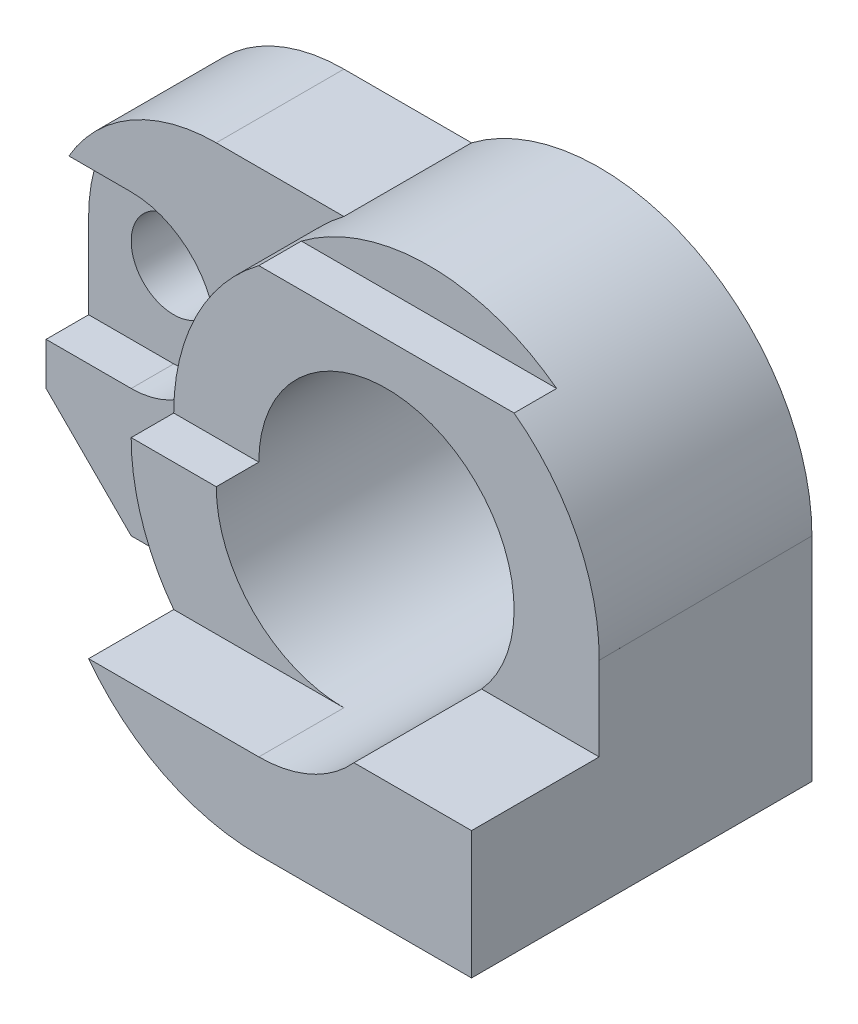
ISO-10303-21;
HEADER;
FILE_DESCRIPTION(('STEP AP214'),'2;1');
FILE_NAME('part.step','',(''),(''),'','','');
FILE_SCHEMA(('AUTOMOTIVE_DESIGN { 1 0 10303 214 1 1 1 1 }'));
ENDSEC;
DATA;
#1=APPLICATION_CONTEXT('core data for automotive mechanical design processes');
#2=APPLICATION_PROTOCOL_DEFINITION('international standard','automotive_design',2000,#1);
#3=PRODUCT_CONTEXT('',#1,'mechanical');
#4=PRODUCT('Part','Part','',(#3));
#5=PRODUCT_RELATED_PRODUCT_CATEGORY('part','',(#4));
#6=PRODUCT_DEFINITION_FORMATION('','',#4);
#7=PRODUCT_DEFINITION_CONTEXT('part definition',#1,'design');
#8=PRODUCT_DEFINITION('design','',#6,#7);
#9=PRODUCT_DEFINITION_SHAPE('','',#8);
#10=(LENGTH_UNIT() NAMED_UNIT(*) SI_UNIT(.MILLI.,.METRE.));
#11=(NAMED_UNIT(*) PLANE_ANGLE_UNIT() SI_UNIT($,.RADIAN.));
#12=(NAMED_UNIT(*) SI_UNIT($,.STERADIAN.) SOLID_ANGLE_UNIT());
#13=UNCERTAINTY_MEASURE_WITH_UNIT(LENGTH_MEASURE(1.E-05),#10,'distance_accuracy_value','');
#14=(GEOMETRIC_REPRESENTATION_CONTEXT(3) GLOBAL_UNCERTAINTY_ASSIGNED_CONTEXT((#13)) GLOBAL_UNIT_ASSIGNED_CONTEXT((#10,
#11,#12)) REPRESENTATION_CONTEXT('',''));
#15=CARTESIAN_POINT('',(0.,0.,0.));
#16=DIRECTION('',(0.,0.,1.));
#17=DIRECTION('',(1.,0.,0.));
#18=AXIS2_PLACEMENT_3D('',#15,#16,#17);
#19=CARTESIAN_POINT('',(0.,0.,40.));
#20=DIRECTION('',(0.,0.,-1.));
#21=DIRECTION('',(-1.,0.,0.));
#22=AXIS2_PLACEMENT_3D('',#19,#20,#21);
#23=CYLINDRICAL_SURFACE('',#22,50.);
#24=CARTESIAN_POINT('',(0.,0.,30.));
#25=DIRECTION('',(0.,0.,-1.));
#26=DIRECTION('',(-1.,0.,0.));
#27=AXIS2_PLACEMENT_3D('',#24,#25,#26);
#28=CIRCLE('',#27,50.);
#29=CARTESIAN_POINT('',(0.,-50.,30.));
#30=VERTEX_POINT('',#29);
#31=CARTESIAN_POINT('',(-30.,40.,30.));
#32=VERTEX_POINT('',#31);
#33=EDGE_CURVE('E195',#30,#32,#28,.T.);
#34=ORIENTED_EDGE('',*,*,#33,.F.);
#35=DIRECTION('',(0.,0.,-1.));
#36=VECTOR('',#35,1.);
#37=CARTESIAN_POINT('',(0.,-50.,50.));
#38=LINE('',#37,#36);
#39=CARTESIAN_POINT('',(0.,-50.,80.));
#40=VERTEX_POINT('',#39);
#41=EDGE_CURVE('E180',#40,#30,#38,.T.);
#42=ORIENTED_EDGE('',*,*,#41,.F.);
#43=CARTESIAN_POINT('',(0.,0.,80.));
#44=DIRECTION('',(0.,0.,1.));
#45=DIRECTION('',(1.,0.,0.));
#46=AXIS2_PLACEMENT_3D('',#43,#44,#45);
#47=CIRCLE('',#46,50.);
#48=CARTESIAN_POINT('',(-40.,-30.,80.));
#49=VERTEX_POINT('',#48);
#50=EDGE_CURVE('E420',#49,#40,#47,.T.);
#51=ORIENTED_EDGE('',*,*,#50,.F.);
#52=DIRECTION('',(0.,0.,-1.));
#53=VECTOR('',#52,1.);
#54=CARTESIAN_POINT('',(-40.,-30.,70.));
#55=LINE('',#54,#53);
#56=CARTESIAN_POINT('',(-40.,-30.,60.));
#57=VERTEX_POINT('',#56);
#58=EDGE_CURVE('E274',#49,#57,#55,.T.);
#59=ORIENTED_EDGE('',*,*,#58,.T.);
#60=CARTESIAN_POINT('',(0.,0.,60.));
#61=DIRECTION('',(0.,0.,1.));
#62=DIRECTION('',(1.,0.,0.));
#63=AXIS2_PLACEMENT_3D('',#60,#61,#62);
#64=CIRCLE('',#63,50.);
#65=CARTESIAN_POINT('',(-50.,0.,60.));
#66=VERTEX_POINT('',#65);
#67=EDGE_CURVE('E264',#66,#57,#64,.T.);
#68=ORIENTED_EDGE('',*,*,#67,.F.);
#69=DIRECTION('',(0.,0.,-1.));
#70=VECTOR('',#69,1.);
#71=CARTESIAN_POINT('',(-50.,0.,60.));
#72=LINE('',#71,#70);
#73=CARTESIAN_POINT('',(-50.,0.,50.));
#74=VERTEX_POINT('',#73);
#75=EDGE_CURVE('E267',#66,#74,#72,.T.);
#76=ORIENTED_EDGE('',*,*,#75,.T.);
#77=CARTESIAN_POINT('',(0.,0.,50.));
#78=DIRECTION('',(0.,0.,1.));
#79=DIRECTION('',(1.,0.,0.));
#80=AXIS2_PLACEMENT_3D('',#77,#78,#79);
#81=CIRCLE('',#80,50.);
#82=CARTESIAN_POINT('',(-30.,40.,50.));
#83=VERTEX_POINT('',#82);
#84=EDGE_CURVE('E229',#83,#74,#81,.T.);
#85=ORIENTED_EDGE('',*,*,#84,.F.);
#86=DIRECTION('',(0.,0.,1.));
#87=VECTOR('',#86,1.);
#88=CARTESIAN_POINT('',(-30.,40.,40.));
#89=LINE('',#88,#87);
#90=CARTESIAN_POINT('',(-30.,40.,40.));
#91=VERTEX_POINT('',#90);
#92=EDGE_CURVE('E391',#91,#83,#89,.T.);
#93=ORIENTED_EDGE('',*,*,#92,.F.);
#94=CARTESIAN_POINT('',(0.,0.,40.));
#95=DIRECTION('',(0.,0.,1.));
#96=DIRECTION('',(-1.,0.,0.));
#97=AXIS2_PLACEMENT_3D('',#94,#95,#96);
#98=CIRCLE('',#97,50.);
#99=CARTESIAN_POINT('',(30.,40.,40.));
#100=VERTEX_POINT('',#99);
#101=EDGE_CURVE('E424',#100,#91,#98,.T.);
#102=ORIENTED_EDGE('',*,*,#101,.F.);
#103=DIRECTION('',(0.,0.,1.));
#104=VECTOR('',#103,1.);
#105=CARTESIAN_POINT('',(30.,40.,40.));
#106=LINE('',#105,#104);
#107=CARTESIAN_POINT('',(30.,40.,50.));
#108=VERTEX_POINT('',#107);
#109=EDGE_CURVE('E386',#100,#108,#106,.T.);
#110=ORIENTED_EDGE('',*,*,#109,.T.);
#111=CARTESIAN_POINT('',(49.998917391078,-0.329028448868275,50.));
#112=VERTEX_POINT('',#111);
#113=EDGE_CURVE('E230',#112,#108,#81,.T.);
#114=ORIENTED_EDGE('',*,*,#113,.F.);
#115=CARTESIAN_POINT('',(0.,0.,0.));
#116=DIRECTION('',(1.10859201595795E-07,0.999978349488609,0.00658031564788068));
#117=DIRECTION('',(7.29504333114237E-10,0.00658031564788063,-0.999978349488615));
#118=AXIS2_PLACEMENT_3D('',#115,#116,#117);
#119=ELLIPSE('',#118,7598.41969223825,50.);
#120=CARTESIAN_POINT('',(49.9999999999998,-5.54308007596687E-06,0.));
#121=VERTEX_POINT('',#120);
#122=EDGE_CURVE('E382',#112,#121,#119,.T.);
#123=ORIENTED_EDGE('',*,*,#122,.T.);
#124=CARTESIAN_POINT('',(0.,0.,0.));
#125=DIRECTION('',(0.,0.,1.));
#126=DIRECTION('',(1.,0.,0.));
#127=AXIS2_PLACEMENT_3D('',#124,#125,#126);
#128=CIRCLE('',#127,50.);
#129=CARTESIAN_POINT('',(-30.,40.,0.));
#130=VERTEX_POINT('',#129);
#131=EDGE_CURVE('E11',#121,#130,#128,.T.);
#132=ORIENTED_EDGE('',*,*,#131,.T.);
#133=DIRECTION('',(0.,0.,-1.));
#134=VECTOR('',#133,1.);
#135=CARTESIAN_POINT('',(-30.,40.,30.));
#136=LINE('',#135,#134);
#137=EDGE_CURVE('E197',#32,#130,#136,.T.);
#138=ORIENTED_EDGE('',*,*,#137,.F.);
#139=EDGE_LOOP('',(#34,#42,#51,#59,#68,#76,#85,#93,#102,#110,#114,#123,#132,#138));
#140=FACE_BOUND('',#139,.T.);
#141=ADVANCED_FACE('F35',(#140),#23,.T.);
#142=CARTESIAN_POINT('',(0.,0.,0.));
#143=DIRECTION('',(0.,0.,1.));
#144=DIRECTION('',(1.,0.,0.));
#145=AXIS2_PLACEMENT_3D('',#142,#143,#144);
#146=PLANE('',#145);
#147=DIRECTION('',(-1.,0.,0.));
#148=VECTOR('',#147,1.);
#149=CARTESIAN_POINT('',(0.,-50.,0.));
#150=LINE('',#149,#148);
#151=CARTESIAN_POINT('',(49.9999944569202,-50.,0.));
#152=VERTEX_POINT('',#151);
#153=CARTESIAN_POINT('',(-80.,-50.,0.));
#154=VERTEX_POINT('',#153);
#155=EDGE_CURVE('E293',#152,#154,#150,.T.);
#156=ORIENTED_EDGE('',*,*,#155,.T.);
#157=DIRECTION('',(0.707106781186547,-0.707106781186548,0.));
#158=VECTOR('',#157,1.);
#159=CARTESIAN_POINT('',(-65.0000000000001,-65.,0.));
#160=LINE('',#159,#158);
#161=CARTESIAN_POINT('',(-100.,-30.,0.));
#162=VERTEX_POINT('',#161);
#163=EDGE_CURVE('E218',#162,#154,#160,.T.);
#164=ORIENTED_EDGE('',*,*,#163,.F.);
#165=DIRECTION('',(0.,-1.,0.));
#166=VECTOR('',#165,1.);
#167=CARTESIAN_POINT('',(-100.,0.,0.));
#168=LINE('',#167,#166);
#169=CARTESIAN_POINT('',(-100.,0.,0.));
#170=VERTEX_POINT('',#169);
#171=EDGE_CURVE('E212',#170,#162,#168,.T.);
#172=ORIENTED_EDGE('',*,*,#171,.F.);
#173=CARTESIAN_POINT('',(-60.,0.,0.));
#174=DIRECTION('',(0.,0.,1.));
#175=DIRECTION('',(1.,0.,0.));
#176=AXIS2_PLACEMENT_3D('',#173,#174,#175);
#177=CIRCLE('',#176,40.);
#178=CARTESIAN_POINT('',(-60.,40.,0.));
#179=VERTEX_POINT('',#178);
#180=EDGE_CURVE('E333',#170,#179,#177,.F.);
#181=ORIENTED_EDGE('',*,*,#180,.T.);
#182=DIRECTION('',(-1.,0.,0.));
#183=VECTOR('',#182,1.);
#184=CARTESIAN_POINT('',(0.,40.,0.));
#185=LINE('',#184,#183);
#186=EDGE_CURVE('E214',#130,#179,#185,.T.);
#187=ORIENTED_EDGE('',*,*,#186,.F.);
#188=ORIENTED_EDGE('',*,*,#131,.F.);
#189=DIRECTION('',(-1.10861601806167E-07,-0.999999999999994,0.));
#190=VECTOR('',#189,1.);
#191=CARTESIAN_POINT('',(49.9999999999997,-5.54308009030835E-06,0.));
#192=LINE('',#191,#190);
#193=EDGE_CURVE('E56',#121,#152,#192,.T.);
#194=ORIENTED_EDGE('',*,*,#193,.T.);
#195=EDGE_LOOP('',(#156,#164,#172,#181,#187,#188,#194));
#196=FACE_BOUND('',#195,.T.);
#197=CARTESIAN_POINT('',(0.,0.,0.));
#198=DIRECTION('',(0.,0.,1.));
#199=DIRECTION('',(1.,0.,0.));
#200=AXIS2_PLACEMENT_3D('',#197,#198,#199);
#201=CIRCLE('',#200,30.);
#202=CARTESIAN_POINT('',(30.,0.,0.));
#203=VERTEX_POINT('',#202);
#204=EDGE_CURVE('E42',#203,#203,#201,.T.);
#205=ORIENTED_EDGE('',*,*,#204,.T.);
#206=EDGE_LOOP('',(#205));
#207=FACE_BOUND('',#206,.T.);
#208=CARTESIAN_POINT('',(-80.,0.,0.));
#209=DIRECTION('',(0.,0.,1.));
#210=DIRECTION('',(1.,0.,0.));
#211=AXIS2_PLACEMENT_3D('',#208,#209,#210);
#212=CIRCLE('',#211,9.99999999999999);
#213=CARTESIAN_POINT('',(-70.,0.,0.));
#214=VERTEX_POINT('',#213);
#215=EDGE_CURVE('E215',#214,#214,#212,.T.);
#216=ORIENTED_EDGE('',*,*,#215,.T.);
#217=EDGE_LOOP('',(#216));
#218=FACE_BOUND('',#217,.T.);
#219=ADVANCED_FACE('F237',(#196,#207,#218),#146,.F.);
#220=CARTESIAN_POINT('',(49.9999977827683,-20.0000000000002,70.));
#221=DIRECTION('',(0.,-1.,0.));
#222=DIRECTION('',(0.,0.,-1.));
#223=AXIS2_PLACEMENT_3D('',#220,#221,#222);
#224=PLANE('',#223);
#225=DIRECTION('',(-0.999999999999994,1.10861601519336E-07,0.));
#226=VECTOR('',#225,1.);
#227=CARTESIAN_POINT('',(44.9999977827684,-19.9999994456924,50.));
#228=LINE('',#227,#226);
#229=CARTESIAN_POINT('',(44.9999977827684,-19.9999994456924,50.));
#230=VERTEX_POINT('',#229);
#231=CARTESIAN_POINT('',(29.9999977827685,-19.9999977827683,50.));
#232=VERTEX_POINT('',#231);
#233=EDGE_CURVE('E397',#230,#232,#228,.T.);
#234=ORIENTED_EDGE('',*,*,#233,.T.);
#235=DIRECTION('',(-1.,0.,0.));
#236=VECTOR('',#235,1.);
#237=CARTESIAN_POINT('',(49.9999977827683,-20.0000000000002,50.));
#238=LINE('',#237,#236);
#239=CARTESIAN_POINT('',(22.3606797749977,-20.0000000000002,50.));
#240=VERTEX_POINT('',#239);
#241=EDGE_CURVE('E398',#232,#240,#238,.T.);
#242=ORIENTED_EDGE('',*,*,#241,.T.);
#243=DIRECTION('',(0.,0.,-1.));
#244=VECTOR('',#243,1.);
#245=CARTESIAN_POINT('',(22.3606797749977,-20.0000000000002,70.));
#246=LINE('',#245,#244);
#247=CARTESIAN_POINT('',(22.3606797749977,-20.0000000000002,80.));
#248=VERTEX_POINT('',#247);
#249=EDGE_CURVE('E273',#248,#240,#246,.T.);
#250=ORIENTED_EDGE('',*,*,#249,.F.);
#251=DIRECTION('',(-1.,0.,0.));
#252=VECTOR('',#251,1.);
#253=CARTESIAN_POINT('',(0.,-20.0000000000002,80.));
#254=LINE('',#253,#252);
#255=CARTESIAN_POINT('',(49.9999977827683,-20.0000000000002,80.));
#256=VERTEX_POINT('',#255);
#257=EDGE_CURVE('E409',#256,#248,#254,.T.);
#258=ORIENTED_EDGE('',*,*,#257,.F.);
#259=DIRECTION('',(0.,0.,-1.));
#260=VECTOR('',#259,1.);
#261=CARTESIAN_POINT('',(49.9999977827683,-20.0000000000002,70.));
#262=LINE('',#261,#260);
#263=CARTESIAN_POINT('',(49.9999977827683,-20.0000000000002,50.));
#264=VERTEX_POINT('',#263);
#265=EDGE_CURVE('E277',#256,#264,#262,.T.);
#266=ORIENTED_EDGE('',*,*,#265,.T.);
#267=EDGE_CURVE('E279',#264,#230,#238,.T.);
#268=ORIENTED_EDGE('',*,*,#267,.T.);
#269=EDGE_LOOP('',(#234,#242,#250,#258,#266,#268));
#270=FACE_BOUND('',#269,.T.);
#271=ADVANCED_FACE('F402',(#270),#224,.F.);
#272=CARTESIAN_POINT('',(0.,0.,50.));
#273=DIRECTION('',(0.,0.,1.));
#274=DIRECTION('',(1.,0.,0.));
#275=AXIS2_PLACEMENT_3D('',#272,#273,#274);
#276=PLANE('',#275);
#277=DIRECTION('',(1.,0.,0.));
#278=VECTOR('',#277,1.);
#279=CARTESIAN_POINT('',(-30.,40.,50.));
#280=LINE('',#279,#278);
#281=EDGE_CURVE('E423',#83,#108,#280,.T.);
#282=ORIENTED_EDGE('',*,*,#281,.F.);
#283=ORIENTED_EDGE('',*,*,#84,.T.);
#284=DIRECTION('',(-1.,0.,0.));
#285=VECTOR('',#284,1.);
#286=CARTESIAN_POINT('',(-50.,0.,50.));
#287=LINE('',#286,#285);
#288=CARTESIAN_POINT('',(-30.,0.,50.));
#289=VERTEX_POINT('',#288);
#290=EDGE_CURVE('E258',#289,#74,#287,.T.);
#291=ORIENTED_EDGE('',*,*,#290,.F.);
#292=CARTESIAN_POINT('',(0.,0.,50.));
#293=DIRECTION('',(0.,0.,1.));
#294=DIRECTION('',(1.,0.,0.));
#295=AXIS2_PLACEMENT_3D('',#292,#293,#294);
#296=CIRCLE('',#295,30.);
#297=EDGE_CURVE('E191',#289,#240,#296,.F.);
#298=ORIENTED_EDGE('',*,*,#297,.T.);
#299=ORIENTED_EDGE('',*,*,#241,.F.);
#300=ORIENTED_EDGE('',*,*,#233,.F.);
#301=ORIENTED_EDGE('',*,*,#267,.F.);
#302=DIRECTION('',(-1.10861601683715E-07,-0.999999999999994,0.));
#303=VECTOR('',#302,1.);
#304=CARTESIAN_POINT('',(49.9999974790796,-22.7393500813239,50.));
#305=LINE('',#304,#303);
#306=CARTESIAN_POINT('',(49.9999999635237,-0.329028448988292,50.));
#307=VERTEX_POINT('',#306);
#308=EDGE_CURVE('E388',#307,#264,#305,.T.);
#309=ORIENTED_EDGE('',*,*,#308,.F.);
#310=DIRECTION('',(0.999999999999994,-1.10861601806167E-07,0.));
#311=VECTOR('',#310,1.);
#312=CARTESIAN_POINT('',(34.9999999635238,-0.329026786064265,50.));
#313=LINE('',#312,#311);
#314=EDGE_CURVE('E384',#112,#307,#313,.T.);
#315=ORIENTED_EDGE('',*,*,#314,.F.);
#316=ORIENTED_EDGE('',*,*,#113,.T.);
#317=EDGE_LOOP('',(#282,#283,#291,#298,#299,#300,#301,#309,#315,#316));
#318=FACE_BOUND('',#317,.T.);
#319=ADVANCED_FACE('F244',(#318),#276,.T.);
#320=CARTESIAN_POINT('',(0.,0.,40.));
#321=DIRECTION('',(0.,0.,-1.));
#322=DIRECTION('',(-1.,0.,0.));
#323=AXIS2_PLACEMENT_3D('',#320,#321,#322);
#324=CYLINDRICAL_SURFACE('',#323,30.);
#325=ORIENTED_EDGE('',*,*,#204,.F.);
#326=EDGE_LOOP('',(#325));
#327=FACE_BOUND('',#326,.T.);
#328=CARTESIAN_POINT('',(0.,0.,60.));
#329=DIRECTION('',(0.,0.,-1.));
#330=DIRECTION('',(1.,0.,0.));
#331=AXIS2_PLACEMENT_3D('',#328,#329,#330);
#332=CIRCLE('',#331,30.);
#333=CARTESIAN_POINT('',(0.,-30.,60.));
#334=VERTEX_POINT('',#333);
#335=CARTESIAN_POINT('',(-30.,0.,60.));
#336=VERTEX_POINT('',#335);
#337=EDGE_CURVE('E248',#334,#336,#332,.T.);
#338=ORIENTED_EDGE('',*,*,#337,.F.);
#339=DIRECTION('',(0.,0.,-1.));
#340=VECTOR('',#339,1.);
#341=CARTESIAN_POINT('',(0.,-30.,70.));
#342=LINE('',#341,#340);
#343=CARTESIAN_POINT('',(0.,-30.,80.));
#344=VERTEX_POINT('',#343);
#345=EDGE_CURVE('E252',#344,#334,#342,.T.);
#346=ORIENTED_EDGE('',*,*,#345,.F.);
#347=CARTESIAN_POINT('',(0.,0.,80.));
#348=DIRECTION('',(0.,0.,1.));
#349=DIRECTION('',(1.,0.,0.));
#350=AXIS2_PLACEMENT_3D('',#347,#348,#349);
#351=CIRCLE('',#350,30.);
#352=EDGE_CURVE('E407',#248,#344,#351,.F.);
#353=ORIENTED_EDGE('',*,*,#352,.F.);
#354=ORIENTED_EDGE('',*,*,#249,.T.);
#355=ORIENTED_EDGE('',*,*,#297,.F.);
#356=DIRECTION('',(0.,0.,-1.));
#357=VECTOR('',#356,1.);
#358=CARTESIAN_POINT('',(-30.,0.,60.));
#359=LINE('',#358,#357);
#360=EDGE_CURVE('E255',#336,#289,#359,.T.);
#361=ORIENTED_EDGE('',*,*,#360,.F.);
#362=EDGE_LOOP('',(#338,#346,#353,#354,#355,#361));
#363=FACE_BOUND('',#362,.T.);
#364=ADVANCED_FACE('F240',(#327,#363),#324,.F.);
#365=CARTESIAN_POINT('',(49.9999977826574,-20.001,40.));
#366=DIRECTION('',(0.999999999999994,-1.10861601806167E-07,0.));
#367=DIRECTION('',(1.10861601806167E-07,0.999999999999994,0.));
#368=AXIS2_PLACEMENT_3D('',#365,#366,#367);
#369=PLANE('',#368);
#370=ORIENTED_EDGE('',*,*,#193,.F.);
#371=DIRECTION('',(-7.29504399768381E-10,-0.00658031564788063,0.999978349488615));
#372=VECTOR('',#371,1.);
#373=CARTESIAN_POINT('',(49.9999999635237,-0.329028448988292,50.));
#374=LINE('',#373,#372);
#375=EDGE_CURVE('E380',#121,#307,#374,.T.);
#376=ORIENTED_EDGE('',*,*,#375,.T.);
#377=ORIENTED_EDGE('',*,*,#308,.T.);
#378=ORIENTED_EDGE('',*,*,#265,.F.);
#379=DIRECTION('',(1.10861601611741E-07,0.999999999999994,0.));
#380=VECTOR('',#379,1.);
#381=CARTESIAN_POINT('',(49.9999999999997,-5.54308008058705E-06,80.));
#382=LINE('',#381,#380);
#383=CARTESIAN_POINT('',(49.9999944569202,-50.,80.));
#384=VERTEX_POINT('',#383);
#385=EDGE_CURVE('E414',#384,#256,#382,.T.);
#386=ORIENTED_EDGE('',*,*,#385,.F.);
#387=DIRECTION('',(0.,0.,1.));
#388=VECTOR('',#387,1.);
#389=CARTESIAN_POINT('',(49.9999944569202,-50.,40.));
#390=LINE('',#389,#388);
#391=EDGE_CURVE('E233',#152,#384,#390,.T.);
#392=ORIENTED_EDGE('',*,*,#391,.F.);
#393=EDGE_LOOP('',(#370,#376,#377,#378,#386,#392));
#394=FACE_BOUND('',#393,.T.);
#395=ADVANCED_FACE('F243',(#394),#369,.T.);
#396=CARTESIAN_POINT('',(49.9999944569202,-50.,40.));
#397=DIRECTION('',(0.,-1.,0.));
#398=DIRECTION('',(0.,0.,-1.));
#399=AXIS2_PLACEMENT_3D('',#396,#397,#398);
#400=PLANE('',#399);
#401=DIRECTION('',(0.,0.,-1.));
#402=VECTOR('',#401,1.);
#403=CARTESIAN_POINT('',(-80.,-50.,30.));
#404=LINE('',#403,#402);
#405=CARTESIAN_POINT('',(-80.,-50.,30.));
#406=VERTEX_POINT('',#405);
#407=EDGE_CURVE('E224',#406,#154,#404,.T.);
#408=ORIENTED_EDGE('',*,*,#407,.T.);
#409=ORIENTED_EDGE('',*,*,#155,.F.);
#410=ORIENTED_EDGE('',*,*,#391,.T.);
#411=DIRECTION('',(1.,0.,0.));
#412=VECTOR('',#411,1.);
#413=CARTESIAN_POINT('',(0.,-50.,80.));
#414=LINE('',#413,#412);
#415=EDGE_CURVE('E187',#40,#384,#414,.T.);
#416=ORIENTED_EDGE('',*,*,#415,.F.);
#417=ORIENTED_EDGE('',*,*,#41,.T.);
#418=DIRECTION('',(-1.,0.,0.));
#419=VECTOR('',#418,1.);
#420=CARTESIAN_POINT('',(0.,-50.,30.));
#421=LINE('',#420,#419);
#422=EDGE_CURVE('E185',#30,#406,#421,.T.);
#423=ORIENTED_EDGE('',*,*,#422,.T.);
#424=EDGE_LOOP('',(#408,#409,#410,#416,#417,#423));
#425=FACE_BOUND('',#424,.T.);
#426=ADVANCED_FACE('F183',(#425),#400,.T.);
#427=CARTESIAN_POINT('',(-100.,0.,30.));
#428=DIRECTION('',(1.,0.,0.));
#429=DIRECTION('',(0.,0.,-1.));
#430=AXIS2_PLACEMENT_3D('',#427,#428,#429);
#431=PLANE('',#430);
#432=DIRECTION('',(0.,0.,1.));
#433=VECTOR('',#432,1.);
#434=CARTESIAN_POINT('',(-100.,-20.,20.));
#435=LINE('',#434,#433);
#436=CARTESIAN_POINT('',(-100.,-20.,20.));
#437=VERTEX_POINT('',#436);
#438=CARTESIAN_POINT('',(-100.,-20.,30.));
#439=VERTEX_POINT('',#438);
#440=EDGE_CURVE('E312',#437,#439,#435,.T.);
#441=ORIENTED_EDGE('',*,*,#440,.F.);
#442=DIRECTION('',(0.,-1.,0.));
#443=VECTOR('',#442,1.);
#444=CARTESIAN_POINT('',(-100.,0.,20.));
#445=LINE('',#444,#443);
#446=CARTESIAN_POINT('',(-100.,0.,20.));
#447=VERTEX_POINT('',#446);
#448=EDGE_CURVE('E298',#447,#437,#445,.T.);
#449=ORIENTED_EDGE('',*,*,#448,.F.);
#450=DIRECTION('',(0.,0.,1.));
#451=VECTOR('',#450,1.);
#452=CARTESIAN_POINT('',(-100.,0.,-75.));
#453=LINE('',#452,#451);
#454=EDGE_CURVE('E329',#170,#447,#453,.T.);
#455=ORIENTED_EDGE('',*,*,#454,.F.);
#456=ORIENTED_EDGE('',*,*,#171,.T.);
#457=DIRECTION('',(0.,0.,-1.));
#458=VECTOR('',#457,1.);
#459=CARTESIAN_POINT('',(-100.,-30.,30.));
#460=LINE('',#459,#458);
#461=CARTESIAN_POINT('',(-100.,-30.,30.));
#462=VERTEX_POINT('',#461);
#463=EDGE_CURVE('E192',#462,#162,#460,.T.);
#464=ORIENTED_EDGE('',*,*,#463,.F.);
#465=DIRECTION('',(0.,-1.,0.));
#466=VECTOR('',#465,1.);
#467=CARTESIAN_POINT('',(-100.,0.,30.));
#468=LINE('',#467,#466);
#469=EDGE_CURVE('E221',#439,#462,#468,.T.);
#470=ORIENTED_EDGE('',*,*,#469,.F.);
#471=EDGE_LOOP('',(#441,#449,#455,#456,#464,#470));
#472=FACE_BOUND('',#471,.T.);
#473=ADVANCED_FACE('F355',(#472),#431,.F.);
#474=CARTESIAN_POINT('',(-80.,0.,-75.));
#475=DIRECTION('',(0.,0.,1.));
#476=DIRECTION('',(1.,0.,0.));
#477=AXIS2_PLACEMENT_3D('',#474,#475,#476);
#478=CYLINDRICAL_SURFACE('',#477,9.99999999999999);
#479=ORIENTED_EDGE('',*,*,#215,.F.);
#480=EDGE_LOOP('',(#479));
#481=FACE_BOUND('',#480,.T.);
#482=CARTESIAN_POINT('',(-80.,0.,20.));
#483=DIRECTION('',(0.,0.,1.));
#484=DIRECTION('',(1.,0.,0.));
#485=AXIS2_PLACEMENT_3D('',#482,#483,#484);
#486=CIRCLE('',#485,9.99999999999999);
#487=CARTESIAN_POINT('',(-70.,0.,20.));
#488=VERTEX_POINT('',#487);
#489=EDGE_CURVE('E309',#488,#488,#486,.F.);
#490=ORIENTED_EDGE('',*,*,#489,.F.);
#491=EDGE_LOOP('',(#490));
#492=FACE_BOUND('',#491,.T.);
#493=ADVANCED_FACE('F469',(#481,#492),#478,.F.);
#494=CARTESIAN_POINT('',(0.,40.,30.));
#495=DIRECTION('',(0.,-1.,0.));
#496=DIRECTION('',(0.,0.,-1.));
#497=AXIS2_PLACEMENT_3D('',#494,#495,#496);
#498=PLANE('',#497);
#499=DIRECTION('',(0.,0.,1.));
#500=VECTOR('',#499,1.);
#501=CARTESIAN_POINT('',(-60.,40.,-75.));
#502=LINE('',#501,#500);
#503=CARTESIAN_POINT('',(-60.,40.,30.));
#504=VERTEX_POINT('',#503);
#505=EDGE_CURVE('E330',#179,#504,#502,.T.);
#506=ORIENTED_EDGE('',*,*,#505,.T.);
#507=DIRECTION('',(-1.,0.,0.));
#508=VECTOR('',#507,1.);
#509=CARTESIAN_POINT('',(0.,40.,30.));
#510=LINE('',#509,#508);
#511=EDGE_CURVE('E201',#32,#504,#510,.T.);
#512=ORIENTED_EDGE('',*,*,#511,.F.);
#513=ORIENTED_EDGE('',*,*,#137,.T.);
#514=ORIENTED_EDGE('',*,*,#186,.T.);
#515=EDGE_LOOP('',(#506,#512,#513,#514));
#516=FACE_BOUND('',#515,.T.);
#517=ADVANCED_FACE('F342',(#516),#498,.F.);
#518=CARTESIAN_POINT('',(-65.0000000000001,-65.,30.));
#519=DIRECTION('',(0.707106781186548,0.707106781186547,0.));
#520=DIRECTION('',(-0.707106781186547,0.707106781186548,0.));
#521=AXIS2_PLACEMENT_3D('',#518,#519,#520);
#522=PLANE('',#521);
#523=ORIENTED_EDGE('',*,*,#163,.T.);
#524=ORIENTED_EDGE('',*,*,#407,.F.);
#525=DIRECTION('',(0.707106781186547,-0.707106781186548,0.));
#526=VECTOR('',#525,1.);
#527=CARTESIAN_POINT('',(-65.0000000000001,-65.,30.));
#528=LINE('',#527,#526);
#529=EDGE_CURVE('E206',#462,#406,#528,.T.);
#530=ORIENTED_EDGE('',*,*,#529,.F.);
#531=ORIENTED_EDGE('',*,*,#463,.T.);
#532=EDGE_LOOP('',(#523,#524,#530,#531));
#533=FACE_BOUND('',#532,.T.);
#534=ADVANCED_FACE('F374',(#533),#522,.F.);
#535=CARTESIAN_POINT('',(0.,0.,30.));
#536=DIRECTION('',(0.,0.,-1.));
#537=DIRECTION('',(-1.,0.,0.));
#538=AXIS2_PLACEMENT_3D('',#535,#536,#537);
#539=PLANE('',#538);
#540=CARTESIAN_POINT('',(-60.,0.,30.));
#541=DIRECTION('',(0.,0.,1.));
#542=DIRECTION('',(1.,0.,0.));
#543=AXIS2_PLACEMENT_3D('',#540,#541,#542);
#544=CIRCLE('',#543,40.);
#545=CARTESIAN_POINT('',(-94.6410161513776,20.,30.));
#546=VERTEX_POINT('',#545);
#547=EDGE_CURVE('E322',#546,#504,#544,.F.);
#548=ORIENTED_EDGE('',*,*,#547,.F.);
#549=DIRECTION('',(-1.,0.,0.));
#550=VECTOR('',#549,1.);
#551=CARTESIAN_POINT('',(0.,20.,30.));
#552=LINE('',#551,#550);
#553=CARTESIAN_POINT('',(-80.,20.,30.));
#554=VERTEX_POINT('',#553);
#555=EDGE_CURVE('E299',#554,#546,#552,.T.);
#556=ORIENTED_EDGE('',*,*,#555,.F.);
#557=CARTESIAN_POINT('',(-80.,0.,30.));
#558=DIRECTION('',(0.,0.,1.));
#559=DIRECTION('',(1.,0.,0.));
#560=AXIS2_PLACEMENT_3D('',#557,#558,#559);
#561=CIRCLE('',#560,20.);
#562=CARTESIAN_POINT('',(-80.,-20.,30.));
#563=VERTEX_POINT('',#562);
#564=EDGE_CURVE('E315',#563,#554,#561,.T.);
#565=ORIENTED_EDGE('',*,*,#564,.F.);
#566=DIRECTION('',(-1.,0.,0.));
#567=VECTOR('',#566,1.);
#568=CARTESIAN_POINT('',(0.,-20.,30.));
#569=LINE('',#568,#567);
#570=EDGE_CURVE('E295',#563,#439,#569,.T.);
#571=ORIENTED_EDGE('',*,*,#570,.T.);
#572=ORIENTED_EDGE('',*,*,#469,.T.);
#573=ORIENTED_EDGE('',*,*,#529,.T.);
#574=ORIENTED_EDGE('',*,*,#422,.F.);
#575=ORIENTED_EDGE('',*,*,#33,.T.);
#576=ORIENTED_EDGE('',*,*,#511,.T.);
#577=EDGE_LOOP('',(#548,#556,#565,#571,#572,#573,#574,#575,#576));
#578=FACE_BOUND('',#577,.T.);
#579=ADVANCED_FACE('F204',(#578),#539,.F.);
#580=CARTESIAN_POINT('',(-60.,0.,-75.));
#581=DIRECTION('',(0.,0.,1.));
#582=DIRECTION('',(1.,0.,0.));
#583=AXIS2_PLACEMENT_3D('',#580,#581,#582);
#584=CYLINDRICAL_SURFACE('',#583,40.);
#585=CARTESIAN_POINT('',(-60.,0.,20.));
#586=DIRECTION('',(0.,0.,1.));
#587=DIRECTION('',(1.,0.,0.));
#588=AXIS2_PLACEMENT_3D('',#585,#586,#587);
#589=CIRCLE('',#588,40.);
#590=CARTESIAN_POINT('',(-94.6410161513776,20.,20.));
#591=VERTEX_POINT('',#590);
#592=EDGE_CURVE('E296',#591,#447,#589,.T.);
#593=ORIENTED_EDGE('',*,*,#592,.F.);
#594=DIRECTION('',(0.,0.,1.));
#595=VECTOR('',#594,1.);
#596=CARTESIAN_POINT('',(-94.6410161513776,20.,20.));
#597=LINE('',#596,#595);
#598=EDGE_CURVE('E319',#591,#546,#597,.T.);
#599=ORIENTED_EDGE('',*,*,#598,.T.);
#600=ORIENTED_EDGE('',*,*,#547,.T.);
#601=ORIENTED_EDGE('',*,*,#505,.F.);
#602=ORIENTED_EDGE('',*,*,#180,.F.);
#603=ORIENTED_EDGE('',*,*,#454,.T.);
#604=EDGE_LOOP('',(#593,#599,#600,#601,#602,#603));
#605=FACE_BOUND('',#604,.T.);
#606=ADVANCED_FACE('F346',(#605),#584,.T.);
#607=CARTESIAN_POINT('',(0.,20.,20.));
#608=DIRECTION('',(0.,1.,0.));
#609=DIRECTION('',(0.,0.,1.));
#610=AXIS2_PLACEMENT_3D('',#607,#608,#609);
#611=PLANE('',#610);
#612=ORIENTED_EDGE('',*,*,#555,.T.);
#613=ORIENTED_EDGE('',*,*,#598,.F.);
#614=DIRECTION('',(-1.,0.,0.));
#615=VECTOR('',#614,1.);
#616=CARTESIAN_POINT('',(0.,20.,20.));
#617=LINE('',#616,#615);
#618=CARTESIAN_POINT('',(-80.,20.,20.));
#619=VERTEX_POINT('',#618);
#620=EDGE_CURVE('E307',#619,#591,#617,.T.);
#621=ORIENTED_EDGE('',*,*,#620,.F.);
#622=DIRECTION('',(0.,0.,1.));
#623=VECTOR('',#622,1.);
#624=CARTESIAN_POINT('',(-80.,20.,20.));
#625=LINE('',#624,#623);
#626=EDGE_CURVE('E323',#619,#554,#625,.T.);
#627=ORIENTED_EDGE('',*,*,#626,.T.);
#628=EDGE_LOOP('',(#612,#613,#621,#627));
#629=FACE_BOUND('',#628,.T.);
#630=ADVANCED_FACE('F366',(#629),#611,.F.);
#631=CARTESIAN_POINT('',(-80.,0.,20.));
#632=DIRECTION('',(0.,0.,1.));
#633=DIRECTION('',(1.,0.,0.));
#634=AXIS2_PLACEMENT_3D('',#631,#632,#633);
#635=CYLINDRICAL_SURFACE('',#634,20.);
#636=ORIENTED_EDGE('',*,*,#564,.T.);
#637=ORIENTED_EDGE('',*,*,#626,.F.);
#638=CARTESIAN_POINT('',(-80.,0.,20.));
#639=DIRECTION('',(0.,0.,1.));
#640=DIRECTION('',(1.,0.,0.));
#641=AXIS2_PLACEMENT_3D('',#638,#639,#640);
#642=CIRCLE('',#641,20.);
#643=CARTESIAN_POINT('',(-80.,-20.,20.));
#644=VERTEX_POINT('',#643);
#645=EDGE_CURVE('E304',#644,#619,#642,.T.);
#646=ORIENTED_EDGE('',*,*,#645,.F.);
#647=DIRECTION('',(0.,0.,1.));
#648=VECTOR('',#647,1.);
#649=CARTESIAN_POINT('',(-80.,-20.,20.));
#650=LINE('',#649,#648);
#651=EDGE_CURVE('E325',#644,#563,#650,.T.);
#652=ORIENTED_EDGE('',*,*,#651,.T.);
#653=EDGE_LOOP('',(#636,#637,#646,#652));
#654=FACE_BOUND('',#653,.T.);
#655=ADVANCED_FACE('F370',(#654),#635,.F.);
#656=CARTESIAN_POINT('',(0.,-20.,20.));
#657=DIRECTION('',(0.,1.,0.));
#658=DIRECTION('',(0.,0.,1.));
#659=AXIS2_PLACEMENT_3D('',#656,#657,#658);
#660=PLANE('',#659);
#661=ORIENTED_EDGE('',*,*,#570,.F.);
#662=ORIENTED_EDGE('',*,*,#651,.F.);
#663=DIRECTION('',(-1.,0.,0.));
#664=VECTOR('',#663,1.);
#665=CARTESIAN_POINT('',(0.,-20.,20.));
#666=LINE('',#665,#664);
#667=EDGE_CURVE('E302',#644,#437,#666,.T.);
#668=ORIENTED_EDGE('',*,*,#667,.T.);
#669=ORIENTED_EDGE('',*,*,#440,.T.);
#670=EDGE_LOOP('',(#661,#662,#668,#669));
#671=FACE_BOUND('',#670,.T.);
#672=ADVANCED_FACE('F372',(#671),#660,.T.);
#673=CARTESIAN_POINT('',(0.,0.,20.));
#674=DIRECTION('',(0.,0.,1.));
#675=DIRECTION('',(1.,0.,0.));
#676=AXIS2_PLACEMENT_3D('',#673,#674,#675);
#677=PLANE('',#676);
#678=ORIENTED_EDGE('',*,*,#592,.T.);
#679=ORIENTED_EDGE('',*,*,#448,.T.);
#680=ORIENTED_EDGE('',*,*,#667,.F.);
#681=ORIENTED_EDGE('',*,*,#645,.T.);
#682=ORIENTED_EDGE('',*,*,#620,.T.);
#683=EDGE_LOOP('',(#678,#679,#680,#681,#682));
#684=FACE_BOUND('',#683,.T.);
#685=ORIENTED_EDGE('',*,*,#489,.T.);
#686=EDGE_LOOP('',(#685));
#687=FACE_BOUND('',#686,.T.);
#688=ADVANCED_FACE('F360',(#684,#687),#677,.T.);
#689=CARTESIAN_POINT('',(-50.,0.,60.));
#690=DIRECTION('',(0.,-1.,0.));
#691=DIRECTION('',(1.,0.,0.));
#692=AXIS2_PLACEMENT_3D('',#689,#690,#691);
#693=PLANE('',#692);
#694=ORIENTED_EDGE('',*,*,#290,.T.);
#695=ORIENTED_EDGE('',*,*,#75,.F.);
#696=DIRECTION('',(-1.,0.,0.));
#697=VECTOR('',#696,1.);
#698=CARTESIAN_POINT('',(-50.,0.,60.));
#699=LINE('',#698,#697);
#700=EDGE_CURVE('E257',#336,#66,#699,.T.);
#701=ORIENTED_EDGE('',*,*,#700,.F.);
#702=ORIENTED_EDGE('',*,*,#360,.T.);
#703=EDGE_LOOP('',(#694,#695,#701,#702));
#704=FACE_BOUND('',#703,.T.);
#705=ADVANCED_FACE('F455',(#704),#693,.F.);
#706=CARTESIAN_POINT('',(0.,0.,60.));
#707=DIRECTION('',(0.,0.,1.));
#708=DIRECTION('',(1.,0.,0.));
#709=AXIS2_PLACEMENT_3D('',#706,#707,#708);
#710=PLANE('',#709);
#711=ORIENTED_EDGE('',*,*,#337,.T.);
#712=ORIENTED_EDGE('',*,*,#700,.T.);
#713=ORIENTED_EDGE('',*,*,#67,.T.);
#714=DIRECTION('',(1.,0.,0.));
#715=VECTOR('',#714,1.);
#716=CARTESIAN_POINT('',(-40.,-30.,60.));
#717=LINE('',#716,#715);
#718=EDGE_CURVE('E261',#57,#334,#717,.T.);
#719=ORIENTED_EDGE('',*,*,#718,.T.);
#720=EDGE_LOOP('',(#711,#712,#713,#719));
#721=FACE_BOUND('',#720,.T.);
#722=ADVANCED_FACE('F262',(#721),#710,.T.);
#723=CARTESIAN_POINT('',(-40.,-30.,70.));
#724=DIRECTION('',(0.,-1.,0.));
#725=DIRECTION('',(1.,0.,0.));
#726=AXIS2_PLACEMENT_3D('',#723,#724,#725);
#727=PLANE('',#726);
#728=ORIENTED_EDGE('',*,*,#718,.F.);
#729=ORIENTED_EDGE('',*,*,#58,.F.);
#730=DIRECTION('',(-1.,0.,0.));
#731=VECTOR('',#730,1.);
#732=CARTESIAN_POINT('',(0.,-30.,80.));
#733=LINE('',#732,#731);
#734=EDGE_CURVE('E272',#344,#49,#733,.T.);
#735=ORIENTED_EDGE('',*,*,#734,.F.);
#736=ORIENTED_EDGE('',*,*,#345,.T.);
#737=EDGE_LOOP('',(#728,#729,#735,#736));
#738=FACE_BOUND('',#737,.T.);
#739=ADVANCED_FACE('F270',(#738),#727,.F.);
#740=CARTESIAN_POINT('',(34.9999999635238,-0.329026786064265,50.));
#741=DIRECTION('',(1.10859201595795E-07,0.999978349488609,0.00658031564788068));
#742=DIRECTION('',(0.,-0.00658031564788072,0.999978349488615));
#743=AXIS2_PLACEMENT_3D('',#740,#741,#742);
#744=PLANE('',#743);
#745=ORIENTED_EDGE('',*,*,#122,.F.);
#746=ORIENTED_EDGE('',*,*,#314,.T.);
#747=ORIENTED_EDGE('',*,*,#375,.F.);
#748=EDGE_LOOP('',(#745,#746,#747));
#749=FACE_BOUND('',#748,.T.);
#750=ADVANCED_FACE('F381',(#749),#744,.T.);
#751=CARTESIAN_POINT('',(-30.,40.,40.));
#752=DIRECTION('',(0.,-1.,0.));
#753=DIRECTION('',(0.,0.,-1.));
#754=AXIS2_PLACEMENT_3D('',#751,#752,#753);
#755=PLANE('',#754);
#756=ORIENTED_EDGE('',*,*,#281,.T.);
#757=ORIENTED_EDGE('',*,*,#109,.F.);
#758=DIRECTION('',(1.,0.,0.));
#759=VECTOR('',#758,1.);
#760=CARTESIAN_POINT('',(-30.,40.,40.));
#761=LINE('',#760,#759);
#762=EDGE_CURVE('E48',#91,#100,#761,.T.);
#763=ORIENTED_EDGE('',*,*,#762,.F.);
#764=ORIENTED_EDGE('',*,*,#92,.T.);
#765=EDGE_LOOP('',(#756,#757,#763,#764));
#766=FACE_BOUND('',#765,.T.);
#767=ADVANCED_FACE('F428',(#766),#755,.F.);
#768=CARTESIAN_POINT('',(0.,0.,40.));
#769=DIRECTION('',(0.,0.,-1.));
#770=DIRECTION('',(-1.,0.,0.));
#771=AXIS2_PLACEMENT_3D('',#768,#769,#770);
#772=PLANE('',#771);
#773=ORIENTED_EDGE('',*,*,#101,.T.);
#774=ORIENTED_EDGE('',*,*,#762,.T.);
#775=EDGE_LOOP('',(#773,#774));
#776=FACE_BOUND('',#775,.T.);
#777=ADVANCED_FACE('F546',(#776),#772,.F.);
#778=CARTESIAN_POINT('',(0.,0.,80.));
#779=DIRECTION('',(0.,0.,1.));
#780=DIRECTION('',(1.,0.,0.));
#781=AXIS2_PLACEMENT_3D('',#778,#779,#780);
#782=PLANE('',#781);
#783=ORIENTED_EDGE('',*,*,#385,.T.);
#784=ORIENTED_EDGE('',*,*,#257,.T.);
#785=ORIENTED_EDGE('',*,*,#352,.T.);
#786=ORIENTED_EDGE('',*,*,#734,.T.);
#787=ORIENTED_EDGE('',*,*,#50,.T.);
#788=ORIENTED_EDGE('',*,*,#415,.T.);
#789=EDGE_LOOP('',(#783,#784,#785,#786,#787,#788));
#790=FACE_BOUND('',#789,.T.);
#791=ADVANCED_FACE('F412',(#790),#782,.T.);
#792=CLOSED_SHELL('',(#141,#219,#271,#319,#364,#395,#426,#473,#493,#517,#534,#579,#606,#630,
#655,#672,#688,#705,#722,#739,#750,#767,#777,#791));
#793=MANIFOLD_SOLID_BREP('B2',#792);
#794=ADVANCED_BREP_SHAPE_REPRESENTATION('',(#18,#793),#14);
#795=SHAPE_DEFINITION_REPRESENTATION(#9,#794);
ENDSEC;
END-ISO-10303-21;
